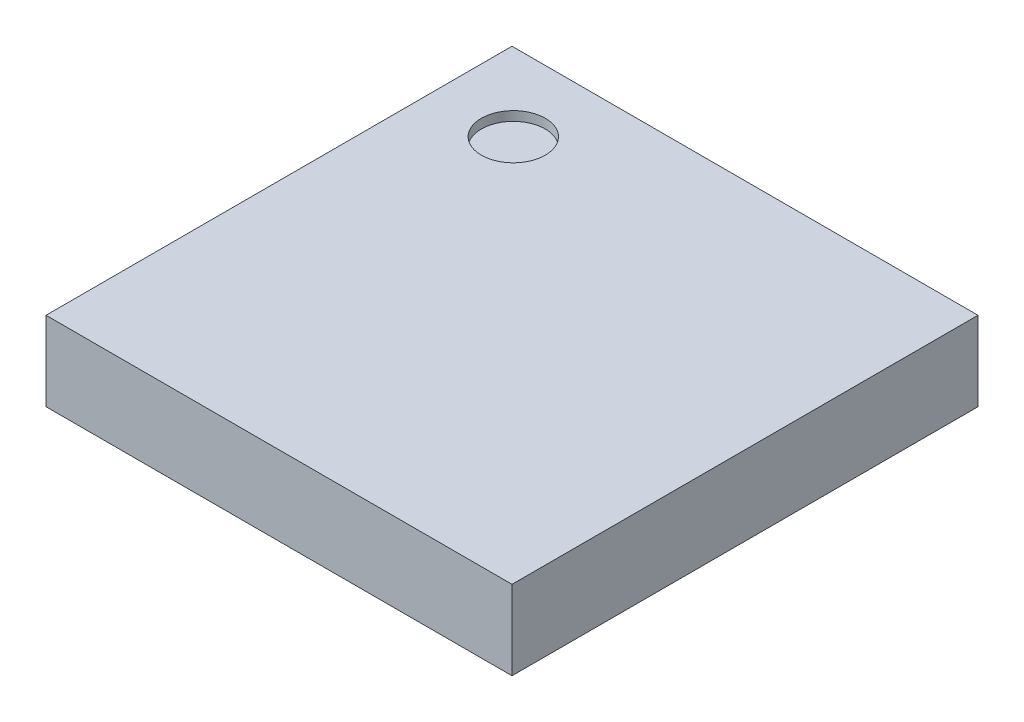
ISO-10303-21;
HEADER;
FILE_DESCRIPTION(('STEP AP214'),'2;1');
FILE_NAME('part.step','',(''),(''),'','','');
FILE_SCHEMA(('AUTOMOTIVE_DESIGN { 1 0 10303 214 1 1 1 1 }'));
ENDSEC;
DATA;
#1=APPLICATION_CONTEXT('core data for automotive mechanical design processes');
#2=APPLICATION_PROTOCOL_DEFINITION('international standard','automotive_design',2000,#1);
#3=PRODUCT_CONTEXT('',#1,'mechanical');
#4=PRODUCT('Part','Part','',(#3));
#5=PRODUCT_RELATED_PRODUCT_CATEGORY('part','',(#4));
#6=PRODUCT_DEFINITION_FORMATION('','',#4);
#7=PRODUCT_DEFINITION_CONTEXT('part definition',#1,'design');
#8=PRODUCT_DEFINITION('design','',#6,#7);
#9=PRODUCT_DEFINITION_SHAPE('','',#8);
#10=(LENGTH_UNIT() NAMED_UNIT(*) SI_UNIT(.MILLI.,.METRE.));
#11=(NAMED_UNIT(*) PLANE_ANGLE_UNIT() SI_UNIT($,.RADIAN.));
#12=(NAMED_UNIT(*) SI_UNIT($,.STERADIAN.) SOLID_ANGLE_UNIT());
#13=UNCERTAINTY_MEASURE_WITH_UNIT(LENGTH_MEASURE(1.E-05),#10,'distance_accuracy_value','');
#14=(GEOMETRIC_REPRESENTATION_CONTEXT(3) GLOBAL_UNCERTAINTY_ASSIGNED_CONTEXT((#13)) GLOBAL_UNIT_ASSIGNED_CONTEXT((#10,
#11,#12)) REPRESENTATION_CONTEXT('',''));
#15=CARTESIAN_POINT('',(0.,0.,0.));
#16=DIRECTION('',(0.,0.,1.));
#17=DIRECTION('',(1.,0.,0.));
#18=AXIS2_PLACEMENT_3D('',#15,#16,#17);
#19=CARTESIAN_POINT('',(-2.5,0.85,2.5));
#20=DIRECTION('',(1.,0.,0.));
#21=DIRECTION('',(0.,0.,-1.));
#22=AXIS2_PLACEMENT_3D('',#19,#20,#21);
#23=PLANE('',#22);
#24=DIRECTION('',(0.,0.,1.));
#25=VECTOR('',#24,1.);
#26=CARTESIAN_POINT('',(-2.5,0.,2.5));
#27=LINE('',#26,#25);
#28=CARTESIAN_POINT('',(-2.5,0.,-2.5));
#29=VERTEX_POINT('',#28);
#30=CARTESIAN_POINT('',(-2.5,0.,2.5));
#31=VERTEX_POINT('',#30);
#32=EDGE_CURVE('E98',#29,#31,#27,.T.);
#33=ORIENTED_EDGE('',*,*,#32,.T.);
#34=DIRECTION('',(0.,-1.,0.));
#35=VECTOR('',#34,1.);
#36=CARTESIAN_POINT('',(-2.5,0.85,2.5));
#37=LINE('',#36,#35);
#38=CARTESIAN_POINT('',(-2.5,0.85,2.5));
#39=VERTEX_POINT('',#38);
#40=EDGE_CURVE('E11',#39,#31,#37,.T.);
#41=ORIENTED_EDGE('',*,*,#40,.F.);
#42=DIRECTION('',(0.,0.,1.));
#43=VECTOR('',#42,1.);
#44=CARTESIAN_POINT('',(-2.5,0.85,2.5));
#45=LINE('',#44,#43);
#46=CARTESIAN_POINT('',(-2.5,0.85,-2.5));
#47=VERTEX_POINT('',#46);
#48=EDGE_CURVE('E86',#47,#39,#45,.T.);
#49=ORIENTED_EDGE('',*,*,#48,.F.);
#50=DIRECTION('',(0.,-1.,0.));
#51=VECTOR('',#50,1.);
#52=CARTESIAN_POINT('',(-2.5,0.85,-2.5));
#53=LINE('',#52,#51);
#54=EDGE_CURVE('E94',#47,#29,#53,.T.);
#55=ORIENTED_EDGE('',*,*,#54,.T.);
#56=EDGE_LOOP('',(#33,#41,#49,#55));
#57=FACE_BOUND('',#56,.T.);
#58=ADVANCED_FACE('F35',(#57),#23,.F.);
#59=CARTESIAN_POINT('',(2.5,0.85,2.5));
#60=DIRECTION('',(0.,0.,-1.));
#61=DIRECTION('',(-1.,0.,0.));
#62=AXIS2_PLACEMENT_3D('',#59,#60,#61);
#63=PLANE('',#62);
#64=DIRECTION('',(1.,0.,0.));
#65=VECTOR('',#64,1.);
#66=CARTESIAN_POINT('',(2.5,0.,2.5));
#67=LINE('',#66,#65);
#68=CARTESIAN_POINT('',(2.5,0.,2.5));
#69=VERTEX_POINT('',#68);
#70=EDGE_CURVE('E90',#31,#69,#67,.T.);
#71=ORIENTED_EDGE('',*,*,#70,.T.);
#72=DIRECTION('',(0.,-1.,0.));
#73=VECTOR('',#72,1.);
#74=CARTESIAN_POINT('',(2.5,0.85,2.5));
#75=LINE('',#74,#73);
#76=CARTESIAN_POINT('',(2.5,0.85,2.5));
#77=VERTEX_POINT('',#76);
#78=EDGE_CURVE('E43',#77,#69,#75,.T.);
#79=ORIENTED_EDGE('',*,*,#78,.F.);
#80=DIRECTION('',(1.,0.,0.));
#81=VECTOR('',#80,1.);
#82=CARTESIAN_POINT('',(2.5,0.85,2.5));
#83=LINE('',#82,#81);
#84=EDGE_CURVE('E81',#39,#77,#83,.T.);
#85=ORIENTED_EDGE('',*,*,#84,.F.);
#86=ORIENTED_EDGE('',*,*,#40,.T.);
#87=EDGE_LOOP('',(#71,#79,#85,#86));
#88=FACE_BOUND('',#87,.T.);
#89=ADVANCED_FACE('F89',(#88),#63,.F.);
#90=CARTESIAN_POINT('',(2.5,0.85,2.5));
#91=DIRECTION('',(-1.,0.,0.));
#92=DIRECTION('',(0.,0.,1.));
#93=AXIS2_PLACEMENT_3D('',#90,#91,#92);
#94=PLANE('',#93);
#95=DIRECTION('',(0.,0.,-1.));
#96=VECTOR('',#95,1.);
#97=CARTESIAN_POINT('',(2.5,0.,2.5));
#98=LINE('',#97,#96);
#99=CARTESIAN_POINT('',(2.5,0.,-2.5));
#100=VERTEX_POINT('',#99);
#101=EDGE_CURVE('E68',#69,#100,#98,.T.);
#102=ORIENTED_EDGE('',*,*,#101,.T.);
#103=DIRECTION('',(0.,-1.,0.));
#104=VECTOR('',#103,1.);
#105=CARTESIAN_POINT('',(2.5,0.85,-2.5));
#106=LINE('',#105,#104);
#107=CARTESIAN_POINT('',(2.5,0.85,-2.5));
#108=VERTEX_POINT('',#107);
#109=EDGE_CURVE('E91',#108,#100,#106,.T.);
#110=ORIENTED_EDGE('',*,*,#109,.F.);
#111=DIRECTION('',(0.,0.,-1.));
#112=VECTOR('',#111,1.);
#113=CARTESIAN_POINT('',(2.5,0.85,2.5));
#114=LINE('',#113,#112);
#115=EDGE_CURVE('E84',#77,#108,#114,.T.);
#116=ORIENTED_EDGE('',*,*,#115,.F.);
#117=ORIENTED_EDGE('',*,*,#78,.T.);
#118=EDGE_LOOP('',(#102,#110,#116,#117));
#119=FACE_BOUND('',#118,.T.);
#120=ADVANCED_FACE('F92',(#119),#94,.F.);
#121=CARTESIAN_POINT('',(2.5,0.85,-2.5));
#122=DIRECTION('',(0.,0.,1.));
#123=DIRECTION('',(1.,0.,0.));
#124=AXIS2_PLACEMENT_3D('',#121,#122,#123);
#125=PLANE('',#124);
#126=DIRECTION('',(-1.,0.,0.));
#127=VECTOR('',#126,1.);
#128=CARTESIAN_POINT('',(2.5,0.,-2.5));
#129=LINE('',#128,#127);
#130=EDGE_CURVE('E74',#100,#29,#129,.T.);
#131=ORIENTED_EDGE('',*,*,#130,.T.);
#132=ORIENTED_EDGE('',*,*,#54,.F.);
#133=DIRECTION('',(-1.,0.,0.));
#134=VECTOR('',#133,1.);
#135=CARTESIAN_POINT('',(2.5,0.85,-2.5));
#136=LINE('',#135,#134);
#137=EDGE_CURVE('E51',#108,#47,#136,.T.);
#138=ORIENTED_EDGE('',*,*,#137,.F.);
#139=ORIENTED_EDGE('',*,*,#109,.T.);
#140=EDGE_LOOP('',(#131,#132,#138,#139));
#141=FACE_BOUND('',#140,.T.);
#142=ADVANCED_FACE('F106',(#141),#125,.F.);
#143=CARTESIAN_POINT('',(0.,0.85,0.));
#144=DIRECTION('',(0.,1.,0.));
#145=DIRECTION('',(0.,0.,1.));
#146=AXIS2_PLACEMENT_3D('',#143,#144,#145);
#147=PLANE('',#146);
#148=CARTESIAN_POINT('',(-1.65207808634607,0.85,-1.66615271476624));
#149=DIRECTION('',(0.,1.,0.));
#150=DIRECTION('',(0.,0.,1.));
#151=AXIS2_PLACEMENT_3D('',#148,#149,#150);
#152=CIRCLE('',#151,0.343107098894482);
#153=CARTESIAN_POINT('',(-1.65207808634607,0.85,-1.32304561587176));
#154=VERTEX_POINT('',#153);
#155=EDGE_CURVE('E112',#154,#154,#152,.T.);
#156=ORIENTED_EDGE('',*,*,#155,.F.);
#157=EDGE_LOOP('',(#156));
#158=FACE_BOUND('',#157,.T.);
#159=ORIENTED_EDGE('',*,*,#48,.T.);
#160=ORIENTED_EDGE('',*,*,#84,.T.);
#161=ORIENTED_EDGE('',*,*,#115,.T.);
#162=ORIENTED_EDGE('',*,*,#137,.T.);
#163=EDGE_LOOP('',(#159,#160,#161,#162));
#164=FACE_BOUND('',#163,.T.);
#165=ADVANCED_FACE('F82',(#158,#164),#147,.T.);
#166=CARTESIAN_POINT('',(0.,0.,0.));
#167=DIRECTION('',(0.,1.,0.));
#168=DIRECTION('',(0.,0.,1.));
#169=AXIS2_PLACEMENT_3D('',#166,#167,#168);
#170=PLANE('',#169);
#171=ORIENTED_EDGE('',*,*,#32,.F.);
#172=ORIENTED_EDGE('',*,*,#130,.F.);
#173=ORIENTED_EDGE('',*,*,#101,.F.);
#174=ORIENTED_EDGE('',*,*,#70,.F.);
#175=EDGE_LOOP('',(#171,#172,#173,#174));
#176=FACE_BOUND('',#175,.T.);
#177=ADVANCED_FACE('F109',(#176),#170,.F.);
#178=CARTESIAN_POINT('',(-1.65207808634607,0.75,-1.66615271476624));
#179=DIRECTION('',(0.,1.,0.));
#180=DIRECTION('',(0.,0.,1.));
#181=AXIS2_PLACEMENT_3D('',#178,#179,#180);
#182=CYLINDRICAL_SURFACE('',#181,0.343107098894482);
#183=CARTESIAN_POINT('',(-1.65207808634607,0.75,-1.66615271476624));
#184=DIRECTION('',(0.,1.,0.));
#185=DIRECTION('',(0.,0.,1.));
#186=AXIS2_PLACEMENT_3D('',#183,#184,#185);
#187=CIRCLE('',#186,0.343107098894482);
#188=CARTESIAN_POINT('',(-1.65207808634607,0.75,-1.32304561587176));
#189=VERTEX_POINT('',#188);
#190=EDGE_CURVE('E101',#189,#189,#187,.T.);
#191=ORIENTED_EDGE('',*,*,#190,.F.);
#192=EDGE_LOOP('',(#191));
#193=FACE_BOUND('',#192,.T.);
#194=ORIENTED_EDGE('',*,*,#155,.T.);
#195=EDGE_LOOP('',(#194));
#196=FACE_BOUND('',#195,.T.);
#197=ADVANCED_FACE('F120',(#193,#196),#182,.F.);
#198=CARTESIAN_POINT('',(-1.65207808634607,0.75,-1.66615271476624));
#199=DIRECTION('',(0.,1.,0.));
#200=DIRECTION('',(0.,0.,1.));
#201=AXIS2_PLACEMENT_3D('',#198,#199,#200);
#202=PLANE('',#201);
#203=ORIENTED_EDGE('',*,*,#190,.T.);
#204=EDGE_LOOP('',(#203));
#205=FACE_BOUND('',#204,.T.);
#206=ADVANCED_FACE('F118',(#205),#202,.T.);
#207=CLOSED_SHELL('',(#58,#89,#120,#142,#165,#177,#197,#206));
#208=MANIFOLD_SOLID_BREP('B2',#207);
#209=ADVANCED_BREP_SHAPE_REPRESENTATION('',(#18,#208),#14);
#210=SHAPE_DEFINITION_REPRESENTATION(#9,#209);
ENDSEC;
END-ISO-10303-21;
